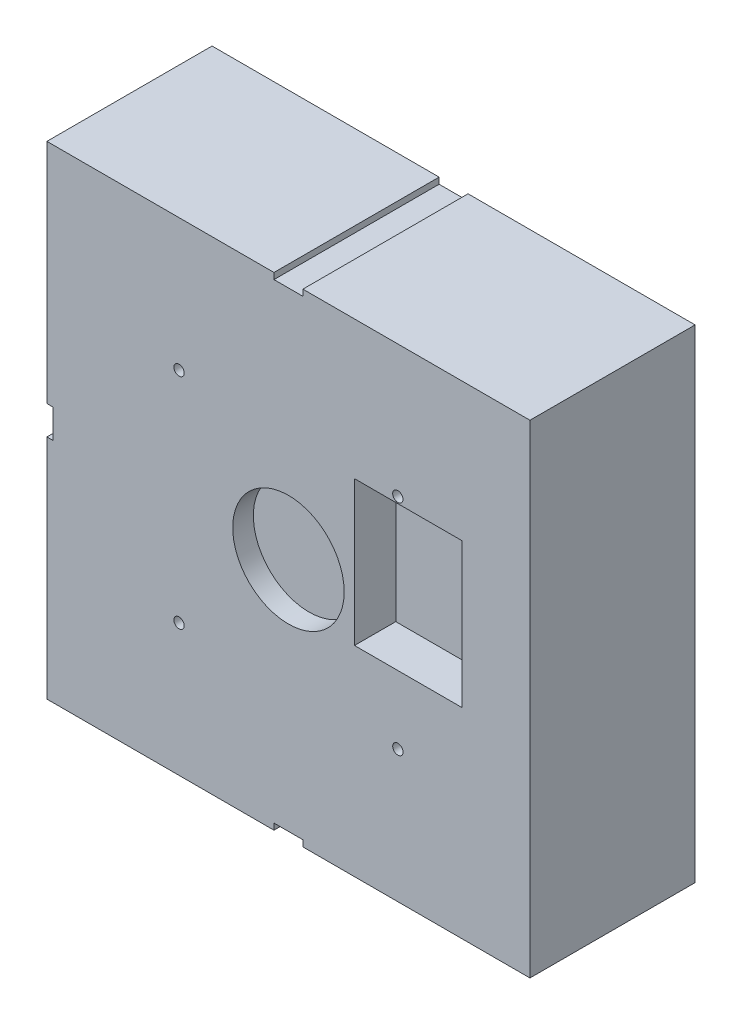
ISO-10303-21;
HEADER;
FILE_DESCRIPTION(('STEP AP214'),'2;1');
FILE_NAME('part.step','',(''),(''),'','','');
FILE_SCHEMA(('AUTOMOTIVE_DESIGN { 1 0 10303 214 1 1 1 1 }'));
ENDSEC;
DATA;
#1=APPLICATION_CONTEXT('core data for automotive mechanical design processes');
#2=APPLICATION_PROTOCOL_DEFINITION('international standard','automotive_design',2000,#1);
#3=PRODUCT_CONTEXT('',#1,'mechanical');
#4=PRODUCT('Part','Part','',(#3));
#5=PRODUCT_RELATED_PRODUCT_CATEGORY('part','',(#4));
#6=PRODUCT_DEFINITION_FORMATION('','',#4);
#7=PRODUCT_DEFINITION_CONTEXT('part definition',#1,'design');
#8=PRODUCT_DEFINITION('design','',#6,#7);
#9=PRODUCT_DEFINITION_SHAPE('','',#8);
#10=(LENGTH_UNIT() NAMED_UNIT(*) SI_UNIT(.MILLI.,.METRE.));
#11=(NAMED_UNIT(*) PLANE_ANGLE_UNIT() SI_UNIT($,.RADIAN.));
#12=(NAMED_UNIT(*) SI_UNIT($,.STERADIAN.) SOLID_ANGLE_UNIT());
#13=UNCERTAINTY_MEASURE_WITH_UNIT(LENGTH_MEASURE(1.E-05),#10,'distance_accuracy_value','');
#14=(GEOMETRIC_REPRESENTATION_CONTEXT(3) GLOBAL_UNCERTAINTY_ASSIGNED_CONTEXT((#13)) GLOBAL_UNIT_ASSIGNED_CONTEXT((#10,
#11,#12)) REPRESENTATION_CONTEXT('',''));
#15=CARTESIAN_POINT('',(0.,0.,0.));
#16=DIRECTION('',(0.,0.,1.));
#17=DIRECTION('',(1.,0.,0.));
#18=AXIS2_PLACEMENT_3D('',#15,#16,#17);
#19=CARTESIAN_POINT('',(-58.5,58.5,40.));
#20=DIRECTION('',(0.,-1.,0.));
#21=DIRECTION('',(0.,0.,-1.));
#22=AXIS2_PLACEMENT_3D('',#19,#20,#21);
#23=PLANE('',#22);
#24=DIRECTION('',(-1.,0.,0.));
#25=VECTOR('',#24,1.);
#26=CARTESIAN_POINT('',(-58.5,58.5,0.));
#27=LINE('',#26,#25);
#28=CARTESIAN_POINT('',(58.5,58.5,0.));
#29=VERTEX_POINT('',#28);
#30=CARTESIAN_POINT('',(3.50000000000001,58.5,0.));
#31=VERTEX_POINT('',#30);
#32=EDGE_CURVE('E387',#29,#31,#27,.T.);
#33=ORIENTED_EDGE('',*,*,#32,.T.);
#34=DIRECTION('',(0.,0.,1.));
#35=VECTOR('',#34,1.);
#36=CARTESIAN_POINT('',(3.5,58.5,40.));
#37=LINE('',#36,#35);
#38=CARTESIAN_POINT('',(3.50000000000001,58.5,40.));
#39=VERTEX_POINT('',#38);
#40=EDGE_CURVE('E359',#31,#39,#37,.T.);
#41=ORIENTED_EDGE('',*,*,#40,.T.);
#42=DIRECTION('',(-1.,0.,0.));
#43=VECTOR('',#42,1.);
#44=CARTESIAN_POINT('',(-58.5,58.5,40.));
#45=LINE('',#44,#43);
#46=CARTESIAN_POINT('',(58.5,58.5,40.));
#47=VERTEX_POINT('',#46);
#48=EDGE_CURVE('E369',#47,#39,#45,.T.);
#49=ORIENTED_EDGE('',*,*,#48,.F.);
#50=DIRECTION('',(0.,0.,-1.));
#51=VECTOR('',#50,1.);
#52=CARTESIAN_POINT('',(58.5,58.5,40.));
#53=LINE('',#52,#51);
#54=EDGE_CURVE('E411',#47,#29,#53,.T.);
#55=ORIENTED_EDGE('',*,*,#54,.T.);
#56=EDGE_LOOP('',(#33,#41,#49,#55));
#57=FACE_BOUND('',#56,.T.);
#58=ADVANCED_FACE('F39',(#57),#23,.F.);
#59=CARTESIAN_POINT('',(-58.5,58.5,40.));
#60=DIRECTION('',(1.,0.,0.));
#61=DIRECTION('',(0.,1.,0.));
#62=AXIS2_PLACEMENT_3D('',#59,#60,#61);
#63=PLANE('',#62);
#64=DIRECTION('',(0.,-1.,0.));
#65=VECTOR('',#64,1.);
#66=CARTESIAN_POINT('',(-58.5,58.5,40.));
#67=LINE('',#66,#65);
#68=CARTESIAN_POINT('',(-58.5,-3.49999999999849,40.));
#69=VERTEX_POINT('',#68);
#70=CARTESIAN_POINT('',(-58.5,-58.5,40.));
#71=VERTEX_POINT('',#70);
#72=EDGE_CURVE('E373',#69,#71,#67,.T.);
#73=ORIENTED_EDGE('',*,*,#72,.F.);
#74=DIRECTION('',(0.,0.,-1.));
#75=VECTOR('',#74,1.);
#76=CARTESIAN_POINT('',(-58.5,-3.49999999999848,40.));
#77=LINE('',#76,#75);
#78=CARTESIAN_POINT('',(-58.5,-3.49999999999849,0.));
#79=VERTEX_POINT('',#78);
#80=EDGE_CURVE('E351',#69,#79,#77,.T.);
#81=ORIENTED_EDGE('',*,*,#80,.T.);
#82=DIRECTION('',(0.,-1.,0.));
#83=VECTOR('',#82,1.);
#84=CARTESIAN_POINT('',(-58.5,58.5,0.));
#85=LINE('',#84,#83);
#86=CARTESIAN_POINT('',(-58.5,-58.5,0.));
#87=VERTEX_POINT('',#86);
#88=EDGE_CURVE('E391',#79,#87,#85,.T.);
#89=ORIENTED_EDGE('',*,*,#88,.T.);
#90=DIRECTION('',(0.,0.,-1.));
#91=VECTOR('',#90,1.);
#92=CARTESIAN_POINT('',(-58.5,-58.5,40.));
#93=LINE('',#92,#91);
#94=EDGE_CURVE('E403',#71,#87,#93,.T.);
#95=ORIENTED_EDGE('',*,*,#94,.F.);
#96=EDGE_LOOP('',(#73,#81,#89,#95));
#97=FACE_BOUND('',#96,.T.);
#98=ADVANCED_FACE('F474',(#97),#63,.F.);
#99=CARTESIAN_POINT('',(-58.5,-58.5,40.));
#100=DIRECTION('',(0.,1.,0.));
#101=DIRECTION('',(0.,0.,1.));
#102=AXIS2_PLACEMENT_3D('',#99,#100,#101);
#103=PLANE('',#102);
#104=DIRECTION('',(1.,0.,0.));
#105=VECTOR('',#104,1.);
#106=CARTESIAN_POINT('',(-58.5,-58.5,40.));
#107=LINE('',#106,#105);
#108=CARTESIAN_POINT('',(3.49999999999673,-58.5,40.));
#109=VERTEX_POINT('',#108);
#110=CARTESIAN_POINT('',(58.5,-58.5,40.));
#111=VERTEX_POINT('',#110);
#112=EDGE_CURVE('E378',#109,#111,#107,.T.);
#113=ORIENTED_EDGE('',*,*,#112,.F.);
#114=DIRECTION('',(0.,0.,-1.));
#115=VECTOR('',#114,1.);
#116=CARTESIAN_POINT('',(3.49999999999673,-58.5,40.));
#117=LINE('',#116,#115);
#118=CARTESIAN_POINT('',(3.49999999999673,-58.5,0.));
#119=VERTEX_POINT('',#118);
#120=EDGE_CURVE('E343',#109,#119,#117,.T.);
#121=ORIENTED_EDGE('',*,*,#120,.T.);
#122=DIRECTION('',(1.,0.,0.));
#123=VECTOR('',#122,1.);
#124=CARTESIAN_POINT('',(-58.5,-58.5,0.));
#125=LINE('',#124,#123);
#126=CARTESIAN_POINT('',(58.5,-58.5,0.));
#127=VERTEX_POINT('',#126);
#128=EDGE_CURVE('E396',#119,#127,#125,.T.);
#129=ORIENTED_EDGE('',*,*,#128,.T.);
#130=DIRECTION('',(0.,0.,-1.));
#131=VECTOR('',#130,1.);
#132=CARTESIAN_POINT('',(58.5,-58.5,40.));
#133=LINE('',#132,#131);
#134=EDGE_CURVE('E383',#111,#127,#133,.T.);
#135=ORIENTED_EDGE('',*,*,#134,.F.);
#136=EDGE_LOOP('',(#113,#121,#129,#135));
#137=FACE_BOUND('',#136,.T.);
#138=ADVANCED_FACE('F451',(#137),#103,.F.);
#139=CARTESIAN_POINT('',(58.5,58.5,40.));
#140=DIRECTION('',(-1.,0.,0.));
#141=DIRECTION('',(0.,-1.,0.));
#142=AXIS2_PLACEMENT_3D('',#139,#140,#141);
#143=PLANE('',#142);
#144=DIRECTION('',(0.,1.,0.));
#145=VECTOR('',#144,1.);
#146=CARTESIAN_POINT('',(58.5,58.5,0.));
#147=LINE('',#146,#145);
#148=EDGE_CURVE('E363',#127,#29,#147,.T.);
#149=ORIENTED_EDGE('',*,*,#148,.T.);
#150=ORIENTED_EDGE('',*,*,#54,.F.);
#151=DIRECTION('',(0.,1.,0.));
#152=VECTOR('',#151,1.);
#153=CARTESIAN_POINT('',(58.5,58.5,40.));
#154=LINE('',#153,#152);
#155=EDGE_CURVE('E364',#111,#47,#154,.T.);
#156=ORIENTED_EDGE('',*,*,#155,.F.);
#157=ORIENTED_EDGE('',*,*,#134,.T.);
#158=EDGE_LOOP('',(#149,#150,#156,#157));
#159=FACE_BOUND('',#158,.T.);
#160=ADVANCED_FACE('F41',(#159),#143,.F.);
#161=CARTESIAN_POINT('',(-3.49999999999999,58.5,40.));
#162=VERTEX_POINT('',#161);
#163=CARTESIAN_POINT('',(-58.5,58.5,40.));
#164=VERTEX_POINT('',#163);
#165=EDGE_CURVE('E367',#162,#164,#45,.T.);
#166=ORIENTED_EDGE('',*,*,#165,.F.);
#167=DIRECTION('',(0.,0.,-1.));
#168=VECTOR('',#167,1.);
#169=CARTESIAN_POINT('',(-3.5,58.5,40.));
#170=LINE('',#169,#168);
#171=CARTESIAN_POINT('',(-3.49999999999999,58.5,0.));
#172=VERTEX_POINT('',#171);
#173=EDGE_CURVE('E355',#162,#172,#170,.T.);
#174=ORIENTED_EDGE('',*,*,#173,.T.);
#175=CARTESIAN_POINT('',(-58.5,58.5,0.));
#176=VERTEX_POINT('',#175);
#177=EDGE_CURVE('E386',#172,#176,#27,.T.);
#178=ORIENTED_EDGE('',*,*,#177,.T.);
#179=DIRECTION('',(0.,0.,-1.));
#180=VECTOR('',#179,1.);
#181=CARTESIAN_POINT('',(-58.5,58.5,40.));
#182=LINE('',#181,#180);
#183=EDGE_CURVE('E407',#164,#176,#182,.T.);
#184=ORIENTED_EDGE('',*,*,#183,.F.);
#185=EDGE_LOOP('',(#166,#174,#178,#184));
#186=FACE_BOUND('',#185,.T.);
#187=ADVANCED_FACE('F434',(#186),#23,.F.);
#188=CARTESIAN_POINT('',(-58.5,3.50000000000152,0.));
#189=VERTEX_POINT('',#188);
#190=EDGE_CURVE('E392',#176,#189,#85,.T.);
#191=ORIENTED_EDGE('',*,*,#190,.T.);
#192=DIRECTION('',(0.,0.,1.));
#193=VECTOR('',#192,1.);
#194=CARTESIAN_POINT('',(-58.5,3.50000000000152,40.));
#195=LINE('',#194,#193);
#196=CARTESIAN_POINT('',(-58.5,3.50000000000151,40.));
#197=VERTEX_POINT('',#196);
#198=EDGE_CURVE('E347',#189,#197,#195,.T.);
#199=ORIENTED_EDGE('',*,*,#198,.T.);
#200=EDGE_CURVE('E374',#164,#197,#67,.T.);
#201=ORIENTED_EDGE('',*,*,#200,.F.);
#202=ORIENTED_EDGE('',*,*,#183,.T.);
#203=EDGE_LOOP('',(#191,#199,#201,#202));
#204=FACE_BOUND('',#203,.T.);
#205=ADVANCED_FACE('F429',(#204),#63,.F.);
#206=CARTESIAN_POINT('',(-3.50000000000327,-58.5,0.));
#207=VERTEX_POINT('',#206);
#208=EDGE_CURVE('E368',#87,#207,#125,.T.);
#209=ORIENTED_EDGE('',*,*,#208,.T.);
#210=DIRECTION('',(0.,0.,1.));
#211=VECTOR('',#210,1.);
#212=CARTESIAN_POINT('',(-3.50000000000327,-58.5,40.));
#213=LINE('',#212,#211);
#214=CARTESIAN_POINT('',(-3.50000000000327,-58.5,40.));
#215=VERTEX_POINT('',#214);
#216=EDGE_CURVE('E287',#207,#215,#213,.T.);
#217=ORIENTED_EDGE('',*,*,#216,.T.);
#218=EDGE_CURVE('E379',#71,#215,#107,.T.);
#219=ORIENTED_EDGE('',*,*,#218,.F.);
#220=ORIENTED_EDGE('',*,*,#94,.T.);
#221=EDGE_LOOP('',(#209,#217,#219,#220));
#222=FACE_BOUND('',#221,.T.);
#223=ADVANCED_FACE('F479',(#222),#103,.F.);
#224=CARTESIAN_POINT('',(0.,0.,40.));
#225=DIRECTION('',(0.,0.,1.));
#226=DIRECTION('',(1.,0.,0.));
#227=AXIS2_PLACEMENT_3D('',#224,#225,#226);
#228=PLANE('',#227);
#229=ORIENTED_EDGE('',*,*,#155,.T.);
#230=ORIENTED_EDGE('',*,*,#48,.T.);
#231=DIRECTION('',(0.,-1.,0.));
#232=VECTOR('',#231,1.);
#233=CARTESIAN_POINT('',(3.50000000000001,57.,40.));
#234=LINE('',#233,#232);
#235=CARTESIAN_POINT('',(3.50000000000001,57.,40.));
#236=VERTEX_POINT('',#235);
#237=EDGE_CURVE('E265',#39,#236,#234,.T.);
#238=ORIENTED_EDGE('',*,*,#237,.T.);
#239=DIRECTION('',(-1.,0.,0.));
#240=VECTOR('',#239,1.);
#241=CARTESIAN_POINT('',(-3.49999999999999,57.,40.));
#242=LINE('',#241,#240);
#243=CARTESIAN_POINT('',(-3.49999999999999,57.,40.));
#244=VERTEX_POINT('',#243);
#245=EDGE_CURVE('E269',#236,#244,#242,.T.);
#246=ORIENTED_EDGE('',*,*,#245,.T.);
#247=DIRECTION('',(0.,1.,0.));
#248=VECTOR('',#247,1.);
#249=CARTESIAN_POINT('',(-3.49999999999999,57.,40.));
#250=LINE('',#249,#248);
#251=EDGE_CURVE('E274',#244,#162,#250,.T.);
#252=ORIENTED_EDGE('',*,*,#251,.T.);
#253=ORIENTED_EDGE('',*,*,#165,.T.);
#254=ORIENTED_EDGE('',*,*,#200,.T.);
#255=DIRECTION('',(1.,0.,0.));
#256=VECTOR('',#255,1.);
#257=CARTESIAN_POINT('',(-57.0000000000018,3.50000000000151,40.));
#258=LINE('',#257,#256);
#259=CARTESIAN_POINT('',(-57.0000000000018,3.50000000000151,40.));
#260=VERTEX_POINT('',#259);
#261=EDGE_CURVE('E290',#197,#260,#258,.T.);
#262=ORIENTED_EDGE('',*,*,#261,.T.);
#263=DIRECTION('',(0.,-1.,0.));
#264=VECTOR('',#263,1.);
#265=CARTESIAN_POINT('',(-57.0000000000018,-3.49999999999849,40.));
#266=LINE('',#265,#264);
#267=CARTESIAN_POINT('',(-57.0000000000018,-3.49999999999849,40.));
#268=VERTEX_POINT('',#267);
#269=EDGE_CURVE('E294',#260,#268,#266,.T.);
#270=ORIENTED_EDGE('',*,*,#269,.T.);
#271=DIRECTION('',(-1.,0.,0.));
#272=VECTOR('',#271,1.);
#273=CARTESIAN_POINT('',(-57.0000000000018,-3.49999999999849,40.));
#274=LINE('',#273,#272);
#275=EDGE_CURVE('E299',#268,#69,#274,.T.);
#276=ORIENTED_EDGE('',*,*,#275,.T.);
#277=ORIENTED_EDGE('',*,*,#72,.T.);
#278=ORIENTED_EDGE('',*,*,#218,.T.);
#279=DIRECTION('',(0.,1.,0.));
#280=VECTOR('',#279,1.);
#281=CARTESIAN_POINT('',(-3.50000000000327,-57.0000000000003,40.));
#282=LINE('',#281,#280);
#283=CARTESIAN_POINT('',(-3.50000000000327,-57.0000000000003,40.));
#284=VERTEX_POINT('',#283);
#285=EDGE_CURVE('E316',#215,#284,#282,.T.);
#286=ORIENTED_EDGE('',*,*,#285,.T.);
#287=DIRECTION('',(1.,0.,0.));
#288=VECTOR('',#287,1.);
#289=CARTESIAN_POINT('',(3.49999999999673,-57.0000000000003,40.));
#290=LINE('',#289,#288);
#291=CARTESIAN_POINT('',(3.49999999999673,-57.0000000000003,40.));
#292=VERTEX_POINT('',#291);
#293=EDGE_CURVE('E320',#284,#292,#290,.T.);
#294=ORIENTED_EDGE('',*,*,#293,.T.);
#295=DIRECTION('',(0.,-1.,0.));
#296=VECTOR('',#295,1.);
#297=CARTESIAN_POINT('',(3.49999999999673,-57.0000000000003,40.));
#298=LINE('',#297,#296);
#299=EDGE_CURVE('E325',#292,#109,#298,.T.);
#300=ORIENTED_EDGE('',*,*,#299,.T.);
#301=ORIENTED_EDGE('',*,*,#112,.T.);
#302=EDGE_LOOP('',(#229,#230,#238,#246,#252,#253,#254,#262,#270,#276,#277,#278,#286,#294,#300,#301));
#303=FACE_BOUND('',#302,.T.);
#304=CARTESIAN_POINT('',(0.,0.,40.));
#305=DIRECTION('',(0.,0.,1.));
#306=DIRECTION('',(1.,0.,0.));
#307=AXIS2_PLACEMENT_3D('',#304,#305,#306);
#308=CIRCLE('',#307,13.5);
#309=CARTESIAN_POINT('',(13.5,0.,40.));
#310=VERTEX_POINT('',#309);
#311=EDGE_CURVE('E208',#310,#310,#308,.T.);
#312=ORIENTED_EDGE('',*,*,#311,.F.);
#313=EDGE_LOOP('',(#312));
#314=FACE_BOUND('',#313,.T.);
#315=DIRECTION('',(0.,-1.,0.));
#316=VECTOR('',#315,1.);
#317=CARTESIAN_POINT('',(16.,0.,40.));
#318=LINE('',#317,#316);
#319=CARTESIAN_POINT('',(16.,25.,40.));
#320=VERTEX_POINT('',#319);
#321=CARTESIAN_POINT('',(16.,-9.99999999999999,40.));
#322=VERTEX_POINT('',#321);
#323=EDGE_CURVE('E55',#320,#322,#318,.T.);
#324=ORIENTED_EDGE('',*,*,#323,.F.);
#325=DIRECTION('',(-1.,0.,0.));
#326=VECTOR('',#325,1.);
#327=CARTESIAN_POINT('',(0.,25.,40.));
#328=LINE('',#327,#326);
#329=CARTESIAN_POINT('',(42.,25.,40.));
#330=VERTEX_POINT('',#329);
#331=EDGE_CURVE('E201',#330,#320,#328,.T.);
#332=ORIENTED_EDGE('',*,*,#331,.F.);
#333=DIRECTION('',(0.,1.,0.));
#334=VECTOR('',#333,1.);
#335=CARTESIAN_POINT('',(42.,0.,40.));
#336=LINE('',#335,#334);
#337=CARTESIAN_POINT('',(42.,-9.99999999999999,40.));
#338=VERTEX_POINT('',#337);
#339=EDGE_CURVE('E205',#338,#330,#336,.T.);
#340=ORIENTED_EDGE('',*,*,#339,.F.);
#341=DIRECTION('',(1.,0.,0.));
#342=VECTOR('',#341,1.);
#343=CARTESIAN_POINT('',(0.,-9.99999999999999,40.));
#344=LINE('',#343,#342);
#345=EDGE_CURVE('E217',#322,#338,#344,.T.);
#346=ORIENTED_EDGE('',*,*,#345,.F.);
#347=EDGE_LOOP('',(#324,#332,#340,#346));
#348=FACE_BOUND('',#347,.T.);
#349=CARTESIAN_POINT('',(26.4999999999995,-26.5,40.));
#350=DIRECTION('',(0.,0.,1.));
#351=DIRECTION('',(1.,0.,0.));
#352=AXIS2_PLACEMENT_3D('',#349,#350,#351);
#353=CIRCLE('',#352,1.25);
#354=CARTESIAN_POINT('',(27.7499999999995,-26.5,40.));
#355=VERTEX_POINT('',#354);
#356=EDGE_CURVE('E227',#355,#355,#353,.T.);
#357=ORIENTED_EDGE('',*,*,#356,.F.);
#358=EDGE_LOOP('',(#357));
#359=FACE_BOUND('',#358,.T.);
#360=CARTESIAN_POINT('',(-26.5000000000005,-26.5,40.));
#361=DIRECTION('',(0.,0.,1.));
#362=DIRECTION('',(1.,0.,0.));
#363=AXIS2_PLACEMENT_3D('',#360,#361,#362);
#364=CIRCLE('',#363,1.25);
#365=CARTESIAN_POINT('',(-25.2500000000005,-26.5,40.));
#366=VERTEX_POINT('',#365);
#367=EDGE_CURVE('E246',#366,#366,#364,.T.);
#368=ORIENTED_EDGE('',*,*,#367,.F.);
#369=EDGE_LOOP('',(#368));
#370=FACE_BOUND('',#369,.T.);
#371=CARTESIAN_POINT('',(-26.5,26.5,40.));
#372=DIRECTION('',(0.,0.,1.));
#373=DIRECTION('',(1.,0.,0.));
#374=AXIS2_PLACEMENT_3D('',#371,#372,#373);
#375=CIRCLE('',#374,1.25);
#376=CARTESIAN_POINT('',(-25.25,26.5,40.));
#377=VERTEX_POINT('',#376);
#378=EDGE_CURVE('E238',#377,#377,#375,.T.);
#379=ORIENTED_EDGE('',*,*,#378,.F.);
#380=EDGE_LOOP('',(#379));
#381=FACE_BOUND('',#380,.T.);
#382=CARTESIAN_POINT('',(26.5,26.5,40.));
#383=DIRECTION('',(0.,0.,1.));
#384=DIRECTION('',(1.,0.,0.));
#385=AXIS2_PLACEMENT_3D('',#382,#383,#384);
#386=CIRCLE('',#385,1.25);
#387=CARTESIAN_POINT('',(27.75,26.5,40.));
#388=VERTEX_POINT('',#387);
#389=EDGE_CURVE('E237',#388,#388,#386,.T.);
#390=ORIENTED_EDGE('',*,*,#389,.F.);
#391=EDGE_LOOP('',(#390));
#392=FACE_BOUND('',#391,.T.);
#393=ADVANCED_FACE('F445',(#303,#314,#348,#359,#370,#381,#392),#228,.T.);
#394=CARTESIAN_POINT('',(0.,0.,0.));
#395=DIRECTION('',(0.,0.,1.));
#396=DIRECTION('',(1.,0.,0.));
#397=AXIS2_PLACEMENT_3D('',#394,#395,#396);
#398=PLANE('',#397);
#399=ORIENTED_EDGE('',*,*,#32,.F.);
#400=ORIENTED_EDGE('',*,*,#148,.F.);
#401=ORIENTED_EDGE('',*,*,#128,.F.);
#402=DIRECTION('',(0.,-1.,0.));
#403=VECTOR('',#402,1.);
#404=CARTESIAN_POINT('',(3.49999999999673,-57.0000000000003,0.));
#405=LINE('',#404,#403);
#406=CARTESIAN_POINT('',(3.49999999999673,-57.0000000000003,0.));
#407=VERTEX_POINT('',#406);
#408=EDGE_CURVE('E321',#407,#119,#405,.T.);
#409=ORIENTED_EDGE('',*,*,#408,.F.);
#410=DIRECTION('',(1.,0.,0.));
#411=VECTOR('',#410,1.);
#412=CARTESIAN_POINT('',(3.49999999999673,-57.0000000000003,0.));
#413=LINE('',#412,#411);
#414=CARTESIAN_POINT('',(-3.50000000000327,-57.0000000000003,0.));
#415=VERTEX_POINT('',#414);
#416=EDGE_CURVE('E261',#415,#407,#413,.T.);
#417=ORIENTED_EDGE('',*,*,#416,.F.);
#418=DIRECTION('',(0.,-1.,0.));
#419=VECTOR('',#418,1.);
#420=CARTESIAN_POINT('',(-3.50000000000326,0.,0.));
#421=LINE('',#420,#419);
#422=EDGE_CURVE('E415',#415,#207,#421,.T.);
#423=ORIENTED_EDGE('',*,*,#422,.T.);
#424=ORIENTED_EDGE('',*,*,#208,.F.);
#425=ORIENTED_EDGE('',*,*,#88,.F.);
#426=DIRECTION('',(-1.,0.,0.));
#427=VECTOR('',#426,1.);
#428=CARTESIAN_POINT('',(-57.0000000000018,-3.49999999999849,0.));
#429=LINE('',#428,#427);
#430=CARTESIAN_POINT('',(-57.0000000000018,-3.49999999999849,0.));
#431=VERTEX_POINT('',#430);
#432=EDGE_CURVE('E295',#431,#79,#429,.T.);
#433=ORIENTED_EDGE('',*,*,#432,.F.);
#434=DIRECTION('',(0.,-1.,0.));
#435=VECTOR('',#434,1.);
#436=CARTESIAN_POINT('',(-57.0000000000018,-3.49999999999849,0.));
#437=LINE('',#436,#435);
#438=CARTESIAN_POINT('',(-57.0000000000018,3.50000000000151,0.));
#439=VERTEX_POINT('',#438);
#440=EDGE_CURVE('E304',#439,#431,#437,.T.);
#441=ORIENTED_EDGE('',*,*,#440,.F.);
#442=DIRECTION('',(-1.,0.,0.));
#443=VECTOR('',#442,1.);
#444=CARTESIAN_POINT('',(0.,3.50000000000151,0.));
#445=LINE('',#444,#443);
#446=EDGE_CURVE('E48',#439,#189,#445,.T.);
#447=ORIENTED_EDGE('',*,*,#446,.T.);
#448=ORIENTED_EDGE('',*,*,#190,.F.);
#449=ORIENTED_EDGE('',*,*,#177,.F.);
#450=DIRECTION('',(0.,1.,0.));
#451=VECTOR('',#450,1.);
#452=CARTESIAN_POINT('',(-3.49999999999999,57.,0.));
#453=LINE('',#452,#451);
#454=CARTESIAN_POINT('',(-3.49999999999999,57.,0.));
#455=VERTEX_POINT('',#454);
#456=EDGE_CURVE('E270',#455,#172,#453,.T.);
#457=ORIENTED_EDGE('',*,*,#456,.F.);
#458=DIRECTION('',(-1.,0.,0.));
#459=VECTOR('',#458,1.);
#460=CARTESIAN_POINT('',(-3.49999999999999,57.,0.));
#461=LINE('',#460,#459);
#462=CARTESIAN_POINT('',(3.50000000000001,57.,0.));
#463=VERTEX_POINT('',#462);
#464=EDGE_CURVE('E278',#463,#455,#461,.T.);
#465=ORIENTED_EDGE('',*,*,#464,.F.);
#466=DIRECTION('',(0.,1.,0.));
#467=VECTOR('',#466,1.);
#468=CARTESIAN_POINT('',(3.50000000000001,0.,0.));
#469=LINE('',#468,#467);
#470=EDGE_CURVE('E11',#463,#31,#469,.T.);
#471=ORIENTED_EDGE('',*,*,#470,.T.);
#472=EDGE_LOOP('',(#399,#400,#401,#409,#417,#423,#424,#425,#433,#441,#447,#448,#449,#457,#465,#471));
#473=FACE_BOUND('',#472,.T.);
#474=ADVANCED_FACE('F424',(#473),#398,.F.);
#475=CARTESIAN_POINT('',(3.49999999999673,-57.0000000000003,40.));
#476=DIRECTION('',(1.,0.,0.));
#477=DIRECTION('',(0.,1.,0.));
#478=AXIS2_PLACEMENT_3D('',#475,#476,#477);
#479=PLANE('',#478);
#480=ORIENTED_EDGE('',*,*,#299,.F.);
#481=DIRECTION('',(0.,0.,-1.));
#482=VECTOR('',#481,1.);
#483=CARTESIAN_POINT('',(3.49999999999673,-57.0000000000003,40.));
#484=LINE('',#483,#482);
#485=EDGE_CURVE('E308',#292,#407,#484,.T.);
#486=ORIENTED_EDGE('',*,*,#485,.T.);
#487=ORIENTED_EDGE('',*,*,#408,.T.);
#488=ORIENTED_EDGE('',*,*,#120,.F.);
#489=EDGE_LOOP('',(#480,#486,#487,#488));
#490=FACE_BOUND('',#489,.T.);
#491=ADVANCED_FACE('F488',(#490),#479,.F.);
#492=CARTESIAN_POINT('',(-3.50000000000327,-57.0000000000003,40.));
#493=DIRECTION('',(-1.,0.,0.));
#494=DIRECTION('',(0.,-1.,0.));
#495=AXIS2_PLACEMENT_3D('',#492,#493,#494);
#496=PLANE('',#495);
#497=ORIENTED_EDGE('',*,*,#422,.F.);
#498=DIRECTION('',(0.,0.,-1.));
#499=VECTOR('',#498,1.);
#500=CARTESIAN_POINT('',(-3.50000000000327,-57.0000000000003,40.));
#501=LINE('',#500,#499);
#502=EDGE_CURVE('E329',#284,#415,#501,.T.);
#503=ORIENTED_EDGE('',*,*,#502,.F.);
#504=ORIENTED_EDGE('',*,*,#285,.F.);
#505=ORIENTED_EDGE('',*,*,#216,.F.);
#506=EDGE_LOOP('',(#497,#503,#504,#505));
#507=FACE_BOUND('',#506,.T.);
#508=ADVANCED_FACE('F482',(#507),#496,.F.);
#509=CARTESIAN_POINT('',(3.49999999999673,-57.0000000000003,40.));
#510=DIRECTION('',(0.,1.,0.));
#511=DIRECTION('',(0.,0.,1.));
#512=AXIS2_PLACEMENT_3D('',#509,#510,#511);
#513=PLANE('',#512);
#514=ORIENTED_EDGE('',*,*,#416,.T.);
#515=ORIENTED_EDGE('',*,*,#485,.F.);
#516=ORIENTED_EDGE('',*,*,#293,.F.);
#517=ORIENTED_EDGE('',*,*,#502,.T.);
#518=EDGE_LOOP('',(#514,#515,#516,#517));
#519=FACE_BOUND('',#518,.T.);
#520=ADVANCED_FACE('F485',(#519),#513,.F.);
#521=CARTESIAN_POINT('',(-57.0000000000018,-3.49999999999849,40.));
#522=DIRECTION('',(0.,-1.,0.));
#523=DIRECTION('',(0.,0.,-1.));
#524=AXIS2_PLACEMENT_3D('',#521,#522,#523);
#525=PLANE('',#524);
#526=ORIENTED_EDGE('',*,*,#275,.F.);
#527=DIRECTION('',(0.,0.,-1.));
#528=VECTOR('',#527,1.);
#529=CARTESIAN_POINT('',(-57.0000000000018,-3.49999999999849,40.));
#530=LINE('',#529,#528);
#531=EDGE_CURVE('E281',#268,#431,#530,.T.);
#532=ORIENTED_EDGE('',*,*,#531,.T.);
#533=ORIENTED_EDGE('',*,*,#432,.T.);
#534=ORIENTED_EDGE('',*,*,#80,.F.);
#535=EDGE_LOOP('',(#526,#532,#533,#534));
#536=FACE_BOUND('',#535,.T.);
#537=ADVANCED_FACE('F470',(#536),#525,.F.);
#538=CARTESIAN_POINT('',(-57.0000000000018,3.50000000000151,40.));
#539=DIRECTION('',(0.,1.,0.));
#540=DIRECTION('',(0.,0.,1.));
#541=AXIS2_PLACEMENT_3D('',#538,#539,#540);
#542=PLANE('',#541);
#543=ORIENTED_EDGE('',*,*,#446,.F.);
#544=DIRECTION('',(0.,0.,-1.));
#545=VECTOR('',#544,1.);
#546=CARTESIAN_POINT('',(-57.0000000000018,3.50000000000151,40.));
#547=LINE('',#546,#545);
#548=EDGE_CURVE('E303',#260,#439,#547,.T.);
#549=ORIENTED_EDGE('',*,*,#548,.F.);
#550=ORIENTED_EDGE('',*,*,#261,.F.);
#551=ORIENTED_EDGE('',*,*,#198,.F.);
#552=EDGE_LOOP('',(#543,#549,#550,#551));
#553=FACE_BOUND('',#552,.T.);
#554=ADVANCED_FACE('F465',(#553),#542,.F.);
#555=CARTESIAN_POINT('',(-57.0000000000018,-3.49999999999849,40.));
#556=DIRECTION('',(1.,0.,0.));
#557=DIRECTION('',(0.,0.,-1.));
#558=AXIS2_PLACEMENT_3D('',#555,#556,#557);
#559=PLANE('',#558);
#560=ORIENTED_EDGE('',*,*,#440,.T.);
#561=ORIENTED_EDGE('',*,*,#531,.F.);
#562=ORIENTED_EDGE('',*,*,#269,.F.);
#563=ORIENTED_EDGE('',*,*,#548,.T.);
#564=EDGE_LOOP('',(#560,#561,#562,#563));
#565=FACE_BOUND('',#564,.T.);
#566=ADVANCED_FACE('F467',(#565),#559,.F.);
#567=CARTESIAN_POINT('',(3.50000000000001,57.,40.));
#568=DIRECTION('',(1.,0.,0.));
#569=DIRECTION('',(0.,0.,-1.));
#570=AXIS2_PLACEMENT_3D('',#567,#568,#569);
#571=PLANE('',#570);
#572=ORIENTED_EDGE('',*,*,#470,.F.);
#573=DIRECTION('',(0.,0.,-1.));
#574=VECTOR('',#573,1.);
#575=CARTESIAN_POINT('',(3.50000000000001,57.,40.));
#576=LINE('',#575,#574);
#577=EDGE_CURVE('E63',#236,#463,#576,.T.);
#578=ORIENTED_EDGE('',*,*,#577,.F.);
#579=ORIENTED_EDGE('',*,*,#237,.F.);
#580=ORIENTED_EDGE('',*,*,#40,.F.);
#581=EDGE_LOOP('',(#572,#578,#579,#580));
#582=FACE_BOUND('',#581,.T.);
#583=ADVANCED_FACE('F458',(#582),#571,.F.);
#584=CARTESIAN_POINT('',(-3.49999999999999,57.,40.));
#585=DIRECTION('',(-1.,0.,0.));
#586=DIRECTION('',(0.,0.,1.));
#587=AXIS2_PLACEMENT_3D('',#584,#585,#586);
#588=PLANE('',#587);
#589=ORIENTED_EDGE('',*,*,#251,.F.);
#590=DIRECTION('',(0.,0.,-1.));
#591=VECTOR('',#590,1.);
#592=CARTESIAN_POINT('',(-3.49999999999999,57.,40.));
#593=LINE('',#592,#591);
#594=EDGE_CURVE('E284',#244,#455,#593,.T.);
#595=ORIENTED_EDGE('',*,*,#594,.T.);
#596=ORIENTED_EDGE('',*,*,#456,.T.);
#597=ORIENTED_EDGE('',*,*,#173,.F.);
#598=EDGE_LOOP('',(#589,#595,#596,#597));
#599=FACE_BOUND('',#598,.T.);
#600=ADVANCED_FACE('F463',(#599),#588,.F.);
#601=CARTESIAN_POINT('',(-3.49999999999999,57.,40.));
#602=DIRECTION('',(0.,-1.,0.));
#603=DIRECTION('',(0.,0.,-1.));
#604=AXIS2_PLACEMENT_3D('',#601,#602,#603);
#605=PLANE('',#604);
#606=ORIENTED_EDGE('',*,*,#464,.T.);
#607=ORIENTED_EDGE('',*,*,#594,.F.);
#608=ORIENTED_EDGE('',*,*,#245,.F.);
#609=ORIENTED_EDGE('',*,*,#577,.T.);
#610=EDGE_LOOP('',(#606,#607,#608,#609));
#611=FACE_BOUND('',#610,.T.);
#612=ADVANCED_FACE('F460',(#611),#605,.F.);
#613=CARTESIAN_POINT('',(26.5,26.5,30.));
#614=DIRECTION('',(0.,0.,1.));
#615=DIRECTION('',(1.,0.,0.));
#616=AXIS2_PLACEMENT_3D('',#613,#614,#615);
#617=CYLINDRICAL_SURFACE('',#616,1.25);
#618=CARTESIAN_POINT('',(26.5,26.5,30.));
#619=DIRECTION('',(0.,0.,1.));
#620=DIRECTION('',(1.,0.,0.));
#621=AXIS2_PLACEMENT_3D('',#618,#619,#620);
#622=CIRCLE('',#621,1.25);
#623=CARTESIAN_POINT('',(27.75,26.5,30.));
#624=VERTEX_POINT('',#623);
#625=EDGE_CURVE('E257',#624,#624,#622,.T.);
#626=ORIENTED_EDGE('',*,*,#625,.F.);
#627=EDGE_LOOP('',(#626));
#628=FACE_BOUND('',#627,.T.);
#629=ORIENTED_EDGE('',*,*,#389,.T.);
#630=EDGE_LOOP('',(#629));
#631=FACE_BOUND('',#630,.T.);
#632=ADVANCED_FACE('F544',(#628,#631),#617,.F.);
#633=CARTESIAN_POINT('',(26.5,26.5,30.));
#634=DIRECTION('',(0.,0.,1.));
#635=DIRECTION('',(1.,0.,0.));
#636=AXIS2_PLACEMENT_3D('',#633,#634,#635);
#637=PLANE('',#636);
#638=ORIENTED_EDGE('',*,*,#625,.T.);
#639=EDGE_LOOP('',(#638));
#640=FACE_BOUND('',#639,.T.);
#641=ADVANCED_FACE('F548',(#640),#637,.T.);
#642=CARTESIAN_POINT('',(-26.5,26.5,30.));
#643=DIRECTION('',(0.,0.,1.));
#644=DIRECTION('',(1.,0.,0.));
#645=AXIS2_PLACEMENT_3D('',#642,#643,#644);
#646=CYLINDRICAL_SURFACE('',#645,1.25);
#647=CARTESIAN_POINT('',(-26.5,26.5,30.));
#648=DIRECTION('',(0.,0.,1.));
#649=DIRECTION('',(1.,0.,0.));
#650=AXIS2_PLACEMENT_3D('',#647,#648,#649);
#651=CIRCLE('',#650,1.25);
#652=CARTESIAN_POINT('',(-25.25,26.5,30.));
#653=VERTEX_POINT('',#652);
#654=EDGE_CURVE('E233',#653,#653,#651,.T.);
#655=ORIENTED_EDGE('',*,*,#654,.F.);
#656=EDGE_LOOP('',(#655));
#657=FACE_BOUND('',#656,.T.);
#658=ORIENTED_EDGE('',*,*,#378,.T.);
#659=EDGE_LOOP('',(#658));
#660=FACE_BOUND('',#659,.T.);
#661=ADVANCED_FACE('F552',(#657,#660),#646,.F.);
#662=CARTESIAN_POINT('',(-26.5,26.5,30.));
#663=DIRECTION('',(0.,0.,1.));
#664=DIRECTION('',(1.,0.,0.));
#665=AXIS2_PLACEMENT_3D('',#662,#663,#664);
#666=PLANE('',#665);
#667=ORIENTED_EDGE('',*,*,#654,.T.);
#668=EDGE_LOOP('',(#667));
#669=FACE_BOUND('',#668,.T.);
#670=ADVANCED_FACE('F566',(#669),#666,.T.);
#671=CARTESIAN_POINT('',(-26.5000000000005,-26.5,30.));
#672=DIRECTION('',(0.,0.,1.));
#673=DIRECTION('',(1.,0.,0.));
#674=AXIS2_PLACEMENT_3D('',#671,#672,#673);
#675=CYLINDRICAL_SURFACE('',#674,1.25);
#676=CARTESIAN_POINT('',(-26.5000000000005,-26.5,30.));
#677=DIRECTION('',(0.,0.,1.));
#678=DIRECTION('',(1.,0.,0.));
#679=AXIS2_PLACEMENT_3D('',#676,#677,#678);
#680=CIRCLE('',#679,1.25);
#681=CARTESIAN_POINT('',(-25.2500000000005,-26.5,30.));
#682=VERTEX_POINT('',#681);
#683=EDGE_CURVE('E242',#682,#682,#680,.T.);
#684=ORIENTED_EDGE('',*,*,#683,.F.);
#685=EDGE_LOOP('',(#684));
#686=FACE_BOUND('',#685,.T.);
#687=ORIENTED_EDGE('',*,*,#367,.T.);
#688=EDGE_LOOP('',(#687));
#689=FACE_BOUND('',#688,.T.);
#690=ADVANCED_FACE('F563',(#686,#689),#675,.F.);
#691=CARTESIAN_POINT('',(-26.5000000000005,-26.5,30.));
#692=DIRECTION('',(0.,0.,1.));
#693=DIRECTION('',(1.,0.,0.));
#694=AXIS2_PLACEMENT_3D('',#691,#692,#693);
#695=PLANE('',#694);
#696=ORIENTED_EDGE('',*,*,#683,.T.);
#697=EDGE_LOOP('',(#696));
#698=FACE_BOUND('',#697,.T.);
#699=ADVANCED_FACE('F558',(#698),#695,.T.);
#700=CARTESIAN_POINT('',(26.4999999999995,-26.5,30.));
#701=DIRECTION('',(0.,0.,1.));
#702=DIRECTION('',(1.,0.,0.));
#703=AXIS2_PLACEMENT_3D('',#700,#701,#702);
#704=CYLINDRICAL_SURFACE('',#703,1.25);
#705=CARTESIAN_POINT('',(26.4999999999995,-26.5,30.));
#706=DIRECTION('',(0.,0.,1.));
#707=DIRECTION('',(1.,0.,0.));
#708=AXIS2_PLACEMENT_3D('',#705,#706,#707);
#709=CIRCLE('',#708,1.25);
#710=CARTESIAN_POINT('',(27.7499999999995,-26.5,30.));
#711=VERTEX_POINT('',#710);
#712=EDGE_CURVE('E250',#711,#711,#709,.T.);
#713=ORIENTED_EDGE('',*,*,#712,.F.);
#714=EDGE_LOOP('',(#713));
#715=FACE_BOUND('',#714,.T.);
#716=ORIENTED_EDGE('',*,*,#356,.T.);
#717=EDGE_LOOP('',(#716));
#718=FACE_BOUND('',#717,.T.);
#719=ADVANCED_FACE('F554',(#715,#718),#704,.F.);
#720=CARTESIAN_POINT('',(26.4999999999995,-26.5,30.));
#721=DIRECTION('',(0.,0.,1.));
#722=DIRECTION('',(1.,0.,0.));
#723=AXIS2_PLACEMENT_3D('',#720,#721,#722);
#724=PLANE('',#723);
#725=ORIENTED_EDGE('',*,*,#712,.T.);
#726=EDGE_LOOP('',(#725));
#727=FACE_BOUND('',#726,.T.);
#728=ADVANCED_FACE('F557',(#727),#724,.T.);
#729=CARTESIAN_POINT('',(16.,0.,30.));
#730=DIRECTION('',(-1.,0.,0.));
#731=DIRECTION('',(0.,0.,1.));
#732=AXIS2_PLACEMENT_3D('',#729,#730,#731);
#733=PLANE('',#732);
#734=ORIENTED_EDGE('',*,*,#323,.T.);
#735=DIRECTION('',(0.,0.,1.));
#736=VECTOR('',#735,1.);
#737=CARTESIAN_POINT('',(16.,-9.99999999999999,30.));
#738=LINE('',#737,#736);
#739=CARTESIAN_POINT('',(16.,-9.99999999999999,30.));
#740=VERTEX_POINT('',#739);
#741=EDGE_CURVE('E176',#740,#322,#738,.T.);
#742=ORIENTED_EDGE('',*,*,#741,.F.);
#743=DIRECTION('',(0.,-1.,0.));
#744=VECTOR('',#743,1.);
#745=CARTESIAN_POINT('',(16.,0.,30.));
#746=LINE('',#745,#744);
#747=CARTESIAN_POINT('',(16.,25.,30.));
#748=VERTEX_POINT('',#747);
#749=EDGE_CURVE('E180',#748,#740,#746,.T.);
#750=ORIENTED_EDGE('',*,*,#749,.F.);
#751=DIRECTION('',(0.,0.,1.));
#752=VECTOR('',#751,1.);
#753=CARTESIAN_POINT('',(16.,25.,30.));
#754=LINE('',#753,#752);
#755=EDGE_CURVE('E224',#748,#320,#754,.T.);
#756=ORIENTED_EDGE('',*,*,#755,.T.);
#757=EDGE_LOOP('',(#734,#742,#750,#756));
#758=FACE_BOUND('',#757,.T.);
#759=ADVANCED_FACE('F178',(#758),#733,.F.);
#760=CARTESIAN_POINT('',(0.,25.,30.));
#761=DIRECTION('',(0.,1.,0.));
#762=DIRECTION('',(-1.,0.,0.));
#763=AXIS2_PLACEMENT_3D('',#760,#761,#762);
#764=PLANE('',#763);
#765=ORIENTED_EDGE('',*,*,#331,.T.);
#766=ORIENTED_EDGE('',*,*,#755,.F.);
#767=DIRECTION('',(-1.,0.,0.));
#768=VECTOR('',#767,1.);
#769=CARTESIAN_POINT('',(0.,25.,30.));
#770=LINE('',#769,#768);
#771=CARTESIAN_POINT('',(42.,25.,30.));
#772=VERTEX_POINT('',#771);
#773=EDGE_CURVE('E187',#772,#748,#770,.T.);
#774=ORIENTED_EDGE('',*,*,#773,.F.);
#775=DIRECTION('',(0.,0.,1.));
#776=VECTOR('',#775,1.);
#777=CARTESIAN_POINT('',(42.,25.,30.));
#778=LINE('',#777,#776);
#779=EDGE_CURVE('E228',#772,#330,#778,.T.);
#780=ORIENTED_EDGE('',*,*,#779,.T.);
#781=EDGE_LOOP('',(#765,#766,#774,#780));
#782=FACE_BOUND('',#781,.T.);
#783=ADVANCED_FACE('F579',(#782),#764,.F.);
#784=CARTESIAN_POINT('',(42.,0.,30.));
#785=DIRECTION('',(1.,0.,0.));
#786=DIRECTION('',(0.,0.,-1.));
#787=AXIS2_PLACEMENT_3D('',#784,#785,#786);
#788=PLANE('',#787);
#789=ORIENTED_EDGE('',*,*,#339,.T.);
#790=ORIENTED_EDGE('',*,*,#779,.F.);
#791=DIRECTION('',(0.,1.,0.));
#792=VECTOR('',#791,1.);
#793=CARTESIAN_POINT('',(42.,0.,30.));
#794=LINE('',#793,#792);
#795=CARTESIAN_POINT('',(42.,-9.99999999999999,30.));
#796=VERTEX_POINT('',#795);
#797=EDGE_CURVE('E196',#796,#772,#794,.T.);
#798=ORIENTED_EDGE('',*,*,#797,.F.);
#799=DIRECTION('',(0.,0.,1.));
#800=VECTOR('',#799,1.);
#801=CARTESIAN_POINT('',(42.,-9.99999999999999,30.));
#802=LINE('',#801,#800);
#803=EDGE_CURVE('E186',#796,#338,#802,.T.);
#804=ORIENTED_EDGE('',*,*,#803,.T.);
#805=EDGE_LOOP('',(#789,#790,#798,#804));
#806=FACE_BOUND('',#805,.T.);
#807=ADVANCED_FACE('F582',(#806),#788,.F.);
#808=CARTESIAN_POINT('',(0.,-9.99999999999999,30.));
#809=DIRECTION('',(0.,-1.,0.));
#810=DIRECTION('',(1.,0.,0.));
#811=AXIS2_PLACEMENT_3D('',#808,#809,#810);
#812=PLANE('',#811);
#813=ORIENTED_EDGE('',*,*,#345,.T.);
#814=ORIENTED_EDGE('',*,*,#803,.F.);
#815=DIRECTION('',(1.,0.,0.));
#816=VECTOR('',#815,1.);
#817=CARTESIAN_POINT('',(0.,-9.99999999999999,30.));
#818=LINE('',#817,#816);
#819=EDGE_CURVE('E190',#740,#796,#818,.T.);
#820=ORIENTED_EDGE('',*,*,#819,.F.);
#821=ORIENTED_EDGE('',*,*,#741,.T.);
#822=EDGE_LOOP('',(#813,#814,#820,#821));
#823=FACE_BOUND('',#822,.T.);
#824=ADVANCED_FACE('F191',(#823),#812,.F.);
#825=CARTESIAN_POINT('',(0.,0.,30.));
#826=DIRECTION('',(0.,0.,1.));
#827=DIRECTION('',(1.,0.,0.));
#828=AXIS2_PLACEMENT_3D('',#825,#826,#827);
#829=PLANE('',#828);
#830=ORIENTED_EDGE('',*,*,#749,.T.);
#831=ORIENTED_EDGE('',*,*,#819,.T.);
#832=ORIENTED_EDGE('',*,*,#797,.T.);
#833=ORIENTED_EDGE('',*,*,#773,.T.);
#834=EDGE_LOOP('',(#830,#831,#832,#833));
#835=FACE_BOUND('',#834,.T.);
#836=ADVANCED_FACE('F198',(#835),#829,.T.);
#837=CARTESIAN_POINT('',(0.,0.,35.));
#838=DIRECTION('',(0.,0.,1.));
#839=DIRECTION('',(1.,0.,0.));
#840=AXIS2_PLACEMENT_3D('',#837,#838,#839);
#841=CYLINDRICAL_SURFACE('',#840,13.5);
#842=CARTESIAN_POINT('',(0.,0.,35.));
#843=DIRECTION('',(0.,0.,1.));
#844=DIRECTION('',(1.,0.,0.));
#845=AXIS2_PLACEMENT_3D('',#842,#843,#844);
#846=CIRCLE('',#845,13.5);
#847=CARTESIAN_POINT('',(13.5,0.,35.));
#848=VERTEX_POINT('',#847);
#849=EDGE_CURVE('E218',#848,#848,#846,.T.);
#850=ORIENTED_EDGE('',*,*,#849,.F.);
#851=EDGE_LOOP('',(#850));
#852=FACE_BOUND('',#851,.T.);
#853=ORIENTED_EDGE('',*,*,#311,.T.);
#854=EDGE_LOOP('',(#853));
#855=FACE_BOUND('',#854,.T.);
#856=ADVANCED_FACE('F591',(#852,#855),#841,.F.);
#857=CARTESIAN_POINT('',(0.,0.,35.));
#858=DIRECTION('',(0.,0.,1.));
#859=DIRECTION('',(1.,0.,0.));
#860=AXIS2_PLACEMENT_3D('',#857,#858,#859);
#861=PLANE('',#860);
#862=ORIENTED_EDGE('',*,*,#849,.T.);
#863=EDGE_LOOP('',(#862));
#864=FACE_BOUND('',#863,.T.);
#865=ADVANCED_FACE('F594',(#864),#861,.T.);
#866=CLOSED_SHELL('',(#58,#98,#138,#160,#187,#205,#223,#393,#474,#491,#508,#520,#537,#554,#566,
#583,#600,#612,#632,#641,#661,#670,#690,#699,#719,#728,#759,#783,#807,#824,#836,#856,#865));
#867=MANIFOLD_SOLID_BREP('B2',#866);
#868=ADVANCED_BREP_SHAPE_REPRESENTATION('',(#18,#867),#14);
#869=SHAPE_DEFINITION_REPRESENTATION(#9,#868);
ENDSEC;
END-ISO-10303-21;
